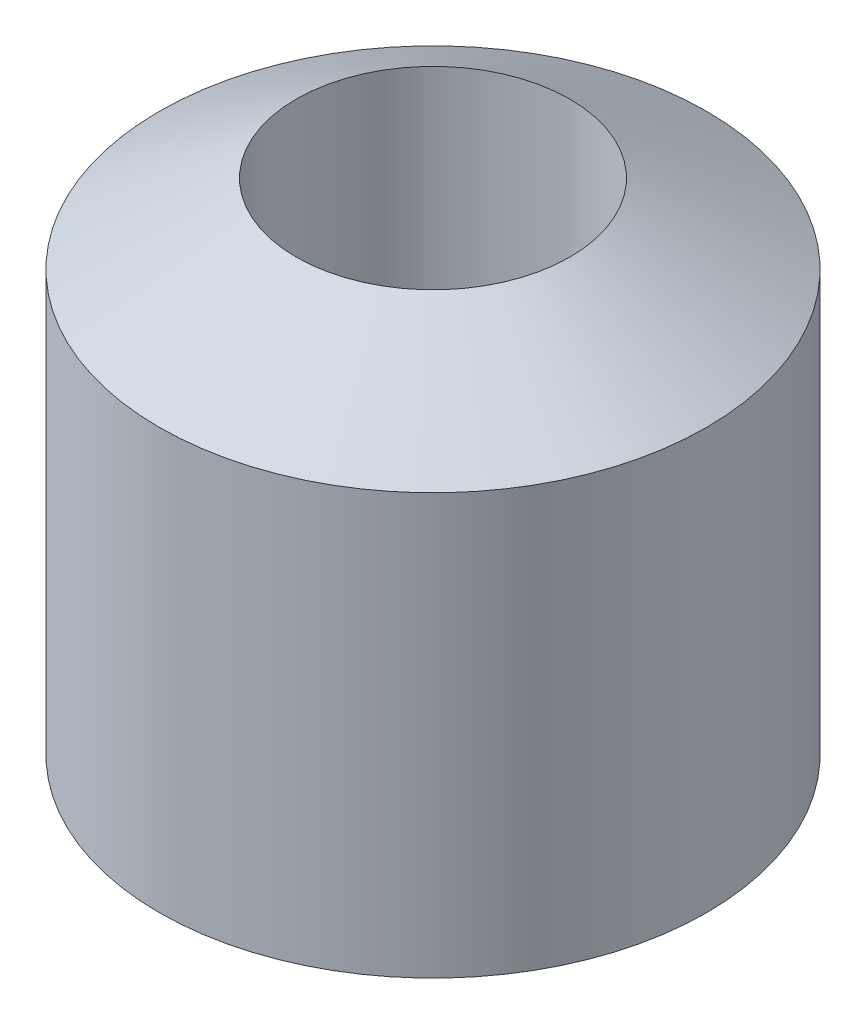
ISO-10303-21;
HEADER;
FILE_DESCRIPTION(('STEP AP214'),'2;1');
FILE_NAME('part.step','',(''),(''),'','','');
FILE_SCHEMA(('AUTOMOTIVE_DESIGN { 1 0 10303 214 1 1 1 1 }'));
ENDSEC;
DATA;
#1=APPLICATION_CONTEXT('core data for automotive mechanical design processes');
#2=APPLICATION_PROTOCOL_DEFINITION('international standard','automotive_design',2000,#1);
#3=PRODUCT_CONTEXT('',#1,'mechanical');
#4=PRODUCT('Part','Part','',(#3));
#5=PRODUCT_RELATED_PRODUCT_CATEGORY('part','',(#4));
#6=PRODUCT_DEFINITION_FORMATION('','',#4);
#7=PRODUCT_DEFINITION_CONTEXT('part definition',#1,'design');
#8=PRODUCT_DEFINITION('design','',#6,#7);
#9=PRODUCT_DEFINITION_SHAPE('','',#8);
#10=(LENGTH_UNIT() NAMED_UNIT(*) SI_UNIT(.MILLI.,.METRE.));
#11=(NAMED_UNIT(*) PLANE_ANGLE_UNIT() SI_UNIT($,.RADIAN.));
#12=(NAMED_UNIT(*) SI_UNIT($,.STERADIAN.) SOLID_ANGLE_UNIT());
#13=UNCERTAINTY_MEASURE_WITH_UNIT(LENGTH_MEASURE(1.E-05),#10,'distance_accuracy_value','');
#14=(GEOMETRIC_REPRESENTATION_CONTEXT(3) GLOBAL_UNCERTAINTY_ASSIGNED_CONTEXT((#13)) GLOBAL_UNIT_ASSIGNED_CONTEXT((#10,
#11,#12)) REPRESENTATION_CONTEXT('',''));
#15=CARTESIAN_POINT('',(0.,0.,0.));
#16=DIRECTION('',(0.,0.,1.));
#17=DIRECTION('',(1.,0.,0.));
#18=AXIS2_PLACEMENT_3D('',#15,#16,#17);
#19=CARTESIAN_POINT('',(0.,-29.5829037686547,0.));
#20=DIRECTION('',(0.,1.,0.));
#21=DIRECTION('',(0.,0.,1.));
#22=AXIS2_PLACEMENT_3D('',#19,#20,#21);
#23=CONICAL_SURFACE('',#22,14.,1.0471975511966);
#24=CARTESIAN_POINT('',(0.,-21.5,0.));
#25=DIRECTION('',(0.,1.,0.));
#26=DIRECTION('',(0.,0.,1.));
#27=AXIS2_PLACEMENT_3D('',#24,#25,#26);
#28=CIRCLE('',#27,28.);
#29=CARTESIAN_POINT('',(0.,-21.5,28.));
#30=VERTEX_POINT('',#29);
#31=EDGE_CURVE('E60',#30,#30,#28,.T.);
#32=ORIENTED_EDGE('',*,*,#31,.F.);
#33=EDGE_LOOP('',(#32));
#34=FACE_BOUND('',#33,.T.);
#35=CARTESIAN_POINT('',(0.,-29.5829037686547,0.));
#36=DIRECTION('',(0.,1.,0.));
#37=DIRECTION('',(0.,0.,1.));
#38=AXIS2_PLACEMENT_3D('',#35,#36,#37);
#39=CIRCLE('',#38,14.);
#40=CARTESIAN_POINT('',(0.,-29.5829037686547,14.));
#41=VERTEX_POINT('',#40);
#42=EDGE_CURVE('E10',#41,#41,#39,.T.);
#43=ORIENTED_EDGE('',*,*,#42,.T.);
#44=EDGE_LOOP('',(#43));
#45=FACE_BOUND('',#44,.T.);
#46=ADVANCED_FACE('F43',(#34,#45),#23,.T.);
#47=CARTESIAN_POINT('',(0.,32.3606557377049,0.));
#48=DIRECTION('',(0.,1.,0.));
#49=DIRECTION('',(0.,0.,1.));
#50=AXIS2_PLACEMENT_3D('',#47,#48,#49);
#51=CYLINDRICAL_SURFACE('',#50,14.);
#52=ORIENTED_EDGE('',*,*,#42,.F.);
#53=EDGE_LOOP('',(#52));
#54=FACE_BOUND('',#53,.T.);
#55=CARTESIAN_POINT('',(0.,29.5829037686547,0.));
#56=DIRECTION('',(0.,1.,0.));
#57=DIRECTION('',(0.,0.,1.));
#58=AXIS2_PLACEMENT_3D('',#55,#56,#57);
#59=CIRCLE('',#58,14.);
#60=CARTESIAN_POINT('',(0.,29.5829037686547,14.));
#61=VERTEX_POINT('',#60);
#62=EDGE_CURVE('E50',#61,#61,#59,.T.);
#63=ORIENTED_EDGE('',*,*,#62,.T.);
#64=EDGE_LOOP('',(#63));
#65=FACE_BOUND('',#64,.T.);
#66=ADVANCED_FACE('F70',(#54,#65),#51,.F.);
#67=CARTESIAN_POINT('',(0.,21.5,0.));
#68=DIRECTION('',(0.,-1.,0.));
#69=DIRECTION('',(0.,0.,-1.));
#70=AXIS2_PLACEMENT_3D('',#67,#68,#69);
#71=CONICAL_SURFACE('',#70,28.,1.0471975511966);
#72=ORIENTED_EDGE('',*,*,#62,.F.);
#73=EDGE_LOOP('',(#72));
#74=FACE_BOUND('',#73,.T.);
#75=CARTESIAN_POINT('',(0.,21.5,0.));
#76=DIRECTION('',(0.,1.,0.));
#77=DIRECTION('',(0.,0.,1.));
#78=AXIS2_PLACEMENT_3D('',#75,#76,#77);
#79=CIRCLE('',#78,28.);
#80=CARTESIAN_POINT('',(0.,21.5,28.));
#81=VERTEX_POINT('',#80);
#82=EDGE_CURVE('E55',#81,#81,#79,.T.);
#83=ORIENTED_EDGE('',*,*,#82,.T.);
#84=EDGE_LOOP('',(#83));
#85=FACE_BOUND('',#84,.T.);
#86=ADVANCED_FACE('F74',(#74,#85),#71,.T.);
#87=CARTESIAN_POINT('',(0.,32.3606557377049,0.));
#88=DIRECTION('',(0.,1.,0.));
#89=DIRECTION('',(0.,0.,1.));
#90=AXIS2_PLACEMENT_3D('',#87,#88,#89);
#91=CYLINDRICAL_SURFACE('',#90,28.);
#92=ORIENTED_EDGE('',*,*,#82,.F.);
#93=EDGE_LOOP('',(#92));
#94=FACE_BOUND('',#93,.T.);
#95=ORIENTED_EDGE('',*,*,#31,.T.);
#96=EDGE_LOOP('',(#95));
#97=FACE_BOUND('',#96,.T.);
#98=ADVANCED_FACE('F67',(#94,#97),#91,.T.);
#99=CLOSED_SHELL('',(#46,#66,#86,#98));
#100=MANIFOLD_SOLID_BREP('B2',#99);
#101=ADVANCED_BREP_SHAPE_REPRESENTATION('',(#18,#100),#14);
#102=SHAPE_DEFINITION_REPRESENTATION(#9,#101);
ENDSEC;
END-ISO-10303-21;
